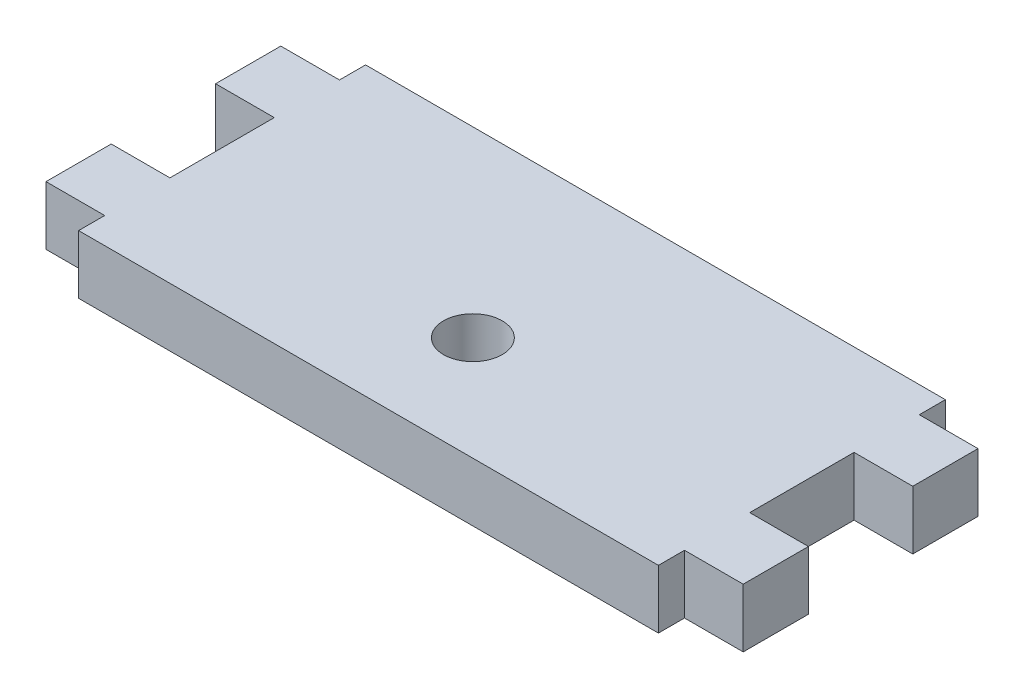
ISO-10303-21;
HEADER;
FILE_DESCRIPTION(('STEP AP214'),'2;1');
FILE_NAME('part.step','',(''),(''),'','','');
FILE_SCHEMA(('AUTOMOTIVE_DESIGN { 1 0 10303 214 1 1 1 1 }'));
ENDSEC;
DATA;
#1=APPLICATION_CONTEXT('core data for automotive mechanical design processes');
#2=APPLICATION_PROTOCOL_DEFINITION('international standard','automotive_design',2000,#1);
#3=PRODUCT_CONTEXT('',#1,'mechanical');
#4=PRODUCT('Part','Part','',(#3));
#5=PRODUCT_RELATED_PRODUCT_CATEGORY('part','',(#4));
#6=PRODUCT_DEFINITION_FORMATION('','',#4);
#7=PRODUCT_DEFINITION_CONTEXT('part definition',#1,'design');
#8=PRODUCT_DEFINITION('design','',#6,#7);
#9=PRODUCT_DEFINITION_SHAPE('','',#8);
#10=(LENGTH_UNIT() NAMED_UNIT(*) SI_UNIT(.MILLI.,.METRE.));
#11=(NAMED_UNIT(*) PLANE_ANGLE_UNIT() SI_UNIT($,.RADIAN.));
#12=(NAMED_UNIT(*) SI_UNIT($,.STERADIAN.) SOLID_ANGLE_UNIT());
#13=UNCERTAINTY_MEASURE_WITH_UNIT(LENGTH_MEASURE(1.E-05),#10,'distance_accuracy_value','');
#14=(GEOMETRIC_REPRESENTATION_CONTEXT(3) GLOBAL_UNCERTAINTY_ASSIGNED_CONTEXT((#13)) GLOBAL_UNIT_ASSIGNED_CONTEXT((#10,
#11,#12)) REPRESENTATION_CONTEXT('',''));
#15=CARTESIAN_POINT('',(0.,0.,0.));
#16=DIRECTION('',(0.,0.,1.));
#17=DIRECTION('',(1.,0.,0.));
#18=AXIS2_PLACEMENT_3D('',#15,#16,#17);
#19=CARTESIAN_POINT('',(-22.225,4.5,-11.));
#20=DIRECTION('',(1.,0.,0.));
#21=DIRECTION('',(0.,0.,-1.));
#22=AXIS2_PLACEMENT_3D('',#19,#20,#21);
#23=PLANE('',#22);
#24=DIRECTION('',(0.,0.,1.));
#25=VECTOR('',#24,1.);
#26=CARTESIAN_POINT('',(-22.225,0.,-11.));
#27=LINE('',#26,#25);
#28=CARTESIAN_POINT('',(-22.225,0.,-11.));
#29=VERTEX_POINT('',#28);
#30=CARTESIAN_POINT('',(-22.225,0.,-9.));
#31=VERTEX_POINT('',#30);
#32=EDGE_CURVE('E149',#29,#31,#27,.T.);
#33=ORIENTED_EDGE('',*,*,#32,.T.);
#34=DIRECTION('',(0.,-1.,0.));
#35=VECTOR('',#34,1.);
#36=CARTESIAN_POINT('',(-22.225,4.5,-9.));
#37=LINE('',#36,#35);
#38=CARTESIAN_POINT('',(-22.225,4.5,-9.));
#39=VERTEX_POINT('',#38);
#40=EDGE_CURVE('E11',#39,#31,#37,.T.);
#41=ORIENTED_EDGE('',*,*,#40,.F.);
#42=DIRECTION('',(0.,0.,1.));
#43=VECTOR('',#42,1.);
#44=CARTESIAN_POINT('',(-22.225,4.5,-11.));
#45=LINE('',#44,#43);
#46=CARTESIAN_POINT('',(-22.225,4.5,-11.));
#47=VERTEX_POINT('',#46);
#48=EDGE_CURVE('E171',#47,#39,#45,.T.);
#49=ORIENTED_EDGE('',*,*,#48,.F.);
#50=DIRECTION('',(0.,-1.,0.));
#51=VECTOR('',#50,1.);
#52=CARTESIAN_POINT('',(-22.225,4.5,-11.));
#53=LINE('',#52,#51);
#54=EDGE_CURVE('E148',#47,#29,#53,.T.);
#55=ORIENTED_EDGE('',*,*,#54,.T.);
#56=EDGE_LOOP('',(#33,#41,#49,#55));
#57=FACE_BOUND('',#56,.T.);
#58=ADVANCED_FACE('F31',(#57),#23,.F.);
#59=CARTESIAN_POINT('',(-22.225,4.5,-9.));
#60=DIRECTION('',(0.,0.,1.));
#61=DIRECTION('',(1.,0.,0.));
#62=AXIS2_PLACEMENT_3D('',#59,#60,#61);
#63=PLANE('',#62);
#64=DIRECTION('',(-1.,0.,0.));
#65=VECTOR('',#64,1.);
#66=CARTESIAN_POINT('',(-22.225,0.,-9.));
#67=LINE('',#66,#65);
#68=CARTESIAN_POINT('',(-26.725,0.,-9.));
#69=VERTEX_POINT('',#68);
#70=EDGE_CURVE('E152',#31,#69,#67,.T.);
#71=ORIENTED_EDGE('',*,*,#70,.T.);
#72=DIRECTION('',(0.,-1.,0.));
#73=VECTOR('',#72,1.);
#74=CARTESIAN_POINT('',(-26.725,4.5,-9.));
#75=LINE('',#74,#73);
#76=CARTESIAN_POINT('',(-26.725,4.5,-9.));
#77=VERTEX_POINT('',#76);
#78=EDGE_CURVE('E39',#77,#69,#75,.T.);
#79=ORIENTED_EDGE('',*,*,#78,.F.);
#80=DIRECTION('',(-1.,0.,0.));
#81=VECTOR('',#80,1.);
#82=CARTESIAN_POINT('',(-22.225,4.5,-9.));
#83=LINE('',#82,#81);
#84=EDGE_CURVE('E99',#39,#77,#83,.T.);
#85=ORIENTED_EDGE('',*,*,#84,.F.);
#86=ORIENTED_EDGE('',*,*,#40,.T.);
#87=EDGE_LOOP('',(#71,#79,#85,#86));
#88=FACE_BOUND('',#87,.T.);
#89=ADVANCED_FACE('F329',(#88),#63,.F.);
#90=CARTESIAN_POINT('',(-26.725,4.5,-4.));
#91=DIRECTION('',(1.,0.,0.));
#92=DIRECTION('',(0.,0.,-1.));
#93=AXIS2_PLACEMENT_3D('',#90,#91,#92);
#94=PLANE('',#93);
#95=DIRECTION('',(0.,0.,1.));
#96=VECTOR('',#95,1.);
#97=CARTESIAN_POINT('',(-26.725,0.,-4.));
#98=LINE('',#97,#96);
#99=CARTESIAN_POINT('',(-26.725,0.,-4.));
#100=VERTEX_POINT('',#99);
#101=EDGE_CURVE('E155',#69,#100,#98,.T.);
#102=ORIENTED_EDGE('',*,*,#101,.T.);
#103=DIRECTION('',(0.,-1.,0.));
#104=VECTOR('',#103,1.);
#105=CARTESIAN_POINT('',(-26.725,4.5,-4.));
#106=LINE('',#105,#104);
#107=CARTESIAN_POINT('',(-26.725,4.5,-4.));
#108=VERTEX_POINT('',#107);
#109=EDGE_CURVE('E184',#108,#100,#106,.T.);
#110=ORIENTED_EDGE('',*,*,#109,.F.);
#111=DIRECTION('',(0.,0.,1.));
#112=VECTOR('',#111,1.);
#113=CARTESIAN_POINT('',(-26.725,4.5,-4.));
#114=LINE('',#113,#112);
#115=EDGE_CURVE('E192',#77,#108,#114,.T.);
#116=ORIENTED_EDGE('',*,*,#115,.F.);
#117=ORIENTED_EDGE('',*,*,#78,.T.);
#118=EDGE_LOOP('',(#102,#110,#116,#117));
#119=FACE_BOUND('',#118,.T.);
#120=ADVANCED_FACE('F190',(#119),#94,.F.);
#121=CARTESIAN_POINT('',(-22.225,4.5,-4.));
#122=DIRECTION('',(0.,0.,-1.));
#123=DIRECTION('',(-1.,0.,0.));
#124=AXIS2_PLACEMENT_3D('',#121,#122,#123);
#125=PLANE('',#124);
#126=DIRECTION('',(1.,0.,0.));
#127=VECTOR('',#126,1.);
#128=CARTESIAN_POINT('',(-22.225,0.,-4.));
#129=LINE('',#128,#127);
#130=CARTESIAN_POINT('',(-22.225,0.,-4.));
#131=VERTEX_POINT('',#130);
#132=EDGE_CURVE('E157',#100,#131,#129,.T.);
#133=ORIENTED_EDGE('',*,*,#132,.T.);
#134=DIRECTION('',(0.,-1.,0.));
#135=VECTOR('',#134,1.);
#136=CARTESIAN_POINT('',(-22.225,4.5,-4.));
#137=LINE('',#136,#135);
#138=CARTESIAN_POINT('',(-22.225,4.5,-4.));
#139=VERTEX_POINT('',#138);
#140=EDGE_CURVE('E181',#139,#131,#137,.T.);
#141=ORIENTED_EDGE('',*,*,#140,.F.);
#142=DIRECTION('',(1.,0.,0.));
#143=VECTOR('',#142,1.);
#144=CARTESIAN_POINT('',(-22.225,4.5,-4.));
#145=LINE('',#144,#143);
#146=EDGE_CURVE('E210',#108,#139,#145,.T.);
#147=ORIENTED_EDGE('',*,*,#146,.F.);
#148=ORIENTED_EDGE('',*,*,#109,.T.);
#149=EDGE_LOOP('',(#133,#141,#147,#148));
#150=FACE_BOUND('',#149,.T.);
#151=ADVANCED_FACE('F201',(#150),#125,.F.);
#152=CARTESIAN_POINT('',(-22.225,4.5,-4.));
#153=DIRECTION('',(1.,0.,0.));
#154=DIRECTION('',(0.,0.,-1.));
#155=AXIS2_PLACEMENT_3D('',#152,#153,#154);
#156=PLANE('',#155);
#157=DIRECTION('',(0.,0.,1.));
#158=VECTOR('',#157,1.);
#159=CARTESIAN_POINT('',(-22.225,0.,-4.));
#160=LINE('',#159,#158);
#161=CARTESIAN_POINT('',(-22.225,0.,4.));
#162=VERTEX_POINT('',#161);
#163=EDGE_CURVE('E159',#131,#162,#160,.T.);
#164=ORIENTED_EDGE('',*,*,#163,.T.);
#165=DIRECTION('',(0.,-1.,0.));
#166=VECTOR('',#165,1.);
#167=CARTESIAN_POINT('',(-22.225,4.5,4.));
#168=LINE('',#167,#166);
#169=CARTESIAN_POINT('',(-22.225,4.5,4.));
#170=VERTEX_POINT('',#169);
#171=EDGE_CURVE('E178',#170,#162,#168,.T.);
#172=ORIENTED_EDGE('',*,*,#171,.F.);
#173=DIRECTION('',(0.,0.,1.));
#174=VECTOR('',#173,1.);
#175=CARTESIAN_POINT('',(-22.225,4.5,-4.));
#176=LINE('',#175,#174);
#177=EDGE_CURVE('E207',#139,#170,#176,.T.);
#178=ORIENTED_EDGE('',*,*,#177,.F.);
#179=ORIENTED_EDGE('',*,*,#140,.T.);
#180=EDGE_LOOP('',(#164,#172,#178,#179));
#181=FACE_BOUND('',#180,.T.);
#182=ADVANCED_FACE('F205',(#181),#156,.F.);
#183=CARTESIAN_POINT('',(-22.225,4.5,4.));
#184=DIRECTION('',(0.,0.,1.));
#185=DIRECTION('',(1.,0.,0.));
#186=AXIS2_PLACEMENT_3D('',#183,#184,#185);
#187=PLANE('',#186);
#188=DIRECTION('',(-1.,0.,0.));
#189=VECTOR('',#188,1.);
#190=CARTESIAN_POINT('',(-22.225,0.,4.));
#191=LINE('',#190,#189);
#192=CARTESIAN_POINT('',(-26.725,0.,4.));
#193=VERTEX_POINT('',#192);
#194=EDGE_CURVE('E161',#162,#193,#191,.T.);
#195=ORIENTED_EDGE('',*,*,#194,.T.);
#196=DIRECTION('',(0.,-1.,0.));
#197=VECTOR('',#196,1.);
#198=CARTESIAN_POINT('',(-26.725,4.5,4.));
#199=LINE('',#198,#197);
#200=CARTESIAN_POINT('',(-26.725,4.5,4.));
#201=VERTEX_POINT('',#200);
#202=EDGE_CURVE('E175',#201,#193,#199,.T.);
#203=ORIENTED_EDGE('',*,*,#202,.F.);
#204=DIRECTION('',(-1.,0.,0.));
#205=VECTOR('',#204,1.);
#206=CARTESIAN_POINT('',(-22.225,4.5,4.));
#207=LINE('',#206,#205);
#208=EDGE_CURVE('E209',#170,#201,#207,.T.);
#209=ORIENTED_EDGE('',*,*,#208,.F.);
#210=ORIENTED_EDGE('',*,*,#171,.T.);
#211=EDGE_LOOP('',(#195,#203,#209,#210));
#212=FACE_BOUND('',#211,.T.);
#213=ADVANCED_FACE('F429',(#212),#187,.F.);
#214=CARTESIAN_POINT('',(-26.725,4.5,9.));
#215=DIRECTION('',(1.,0.,0.));
#216=DIRECTION('',(0.,0.,-1.));
#217=AXIS2_PLACEMENT_3D('',#214,#215,#216);
#218=PLANE('',#217);
#219=DIRECTION('',(0.,0.,1.));
#220=VECTOR('',#219,1.);
#221=CARTESIAN_POINT('',(-26.725,0.,9.));
#222=LINE('',#221,#220);
#223=CARTESIAN_POINT('',(-26.725,0.,9.));
#224=VERTEX_POINT('',#223);
#225=EDGE_CURVE('E163',#193,#224,#222,.T.);
#226=ORIENTED_EDGE('',*,*,#225,.T.);
#227=DIRECTION('',(0.,-1.,0.));
#228=VECTOR('',#227,1.);
#229=CARTESIAN_POINT('',(-26.725,4.5,9.));
#230=LINE('',#229,#228);
#231=CARTESIAN_POINT('',(-26.725,4.5,9.));
#232=VERTEX_POINT('',#231);
#233=EDGE_CURVE('E137',#232,#224,#230,.T.);
#234=ORIENTED_EDGE('',*,*,#233,.F.);
#235=DIRECTION('',(0.,0.,1.));
#236=VECTOR('',#235,1.);
#237=CARTESIAN_POINT('',(-26.725,4.5,9.));
#238=LINE('',#237,#236);
#239=EDGE_CURVE('E128',#201,#232,#238,.T.);
#240=ORIENTED_EDGE('',*,*,#239,.F.);
#241=ORIENTED_EDGE('',*,*,#202,.T.);
#242=EDGE_LOOP('',(#226,#234,#240,#241));
#243=FACE_BOUND('',#242,.T.);
#244=ADVANCED_FACE('F426',(#243),#218,.F.);
#245=CARTESIAN_POINT('',(-22.225,4.5,9.));
#246=DIRECTION('',(0.,0.,-1.));
#247=DIRECTION('',(-1.,0.,0.));
#248=AXIS2_PLACEMENT_3D('',#245,#246,#247);
#249=PLANE('',#248);
#250=DIRECTION('',(1.,0.,0.));
#251=VECTOR('',#250,1.);
#252=CARTESIAN_POINT('',(-22.225,0.,9.));
#253=LINE('',#252,#251);
#254=CARTESIAN_POINT('',(-22.225,0.,9.));
#255=VERTEX_POINT('',#254);
#256=EDGE_CURVE('E136',#224,#255,#253,.T.);
#257=ORIENTED_EDGE('',*,*,#256,.T.);
#258=DIRECTION('',(0.,-1.,0.));
#259=VECTOR('',#258,1.);
#260=CARTESIAN_POINT('',(-22.225,4.5,9.));
#261=LINE('',#260,#259);
#262=CARTESIAN_POINT('',(-22.225,4.5,9.));
#263=VERTEX_POINT('',#262);
#264=EDGE_CURVE('E133',#263,#255,#261,.T.);
#265=ORIENTED_EDGE('',*,*,#264,.F.);
#266=DIRECTION('',(1.,0.,0.));
#267=VECTOR('',#266,1.);
#268=CARTESIAN_POINT('',(-22.225,4.5,9.));
#269=LINE('',#268,#267);
#270=EDGE_CURVE('E121',#232,#263,#269,.T.);
#271=ORIENTED_EDGE('',*,*,#270,.F.);
#272=ORIENTED_EDGE('',*,*,#233,.T.);
#273=EDGE_LOOP('',(#257,#265,#271,#272));
#274=FACE_BOUND('',#273,.T.);
#275=ADVANCED_FACE('F134',(#274),#249,.F.);
#276=CARTESIAN_POINT('',(-22.225,4.5,9.));
#277=DIRECTION('',(1.,0.,0.));
#278=DIRECTION('',(0.,0.,-1.));
#279=AXIS2_PLACEMENT_3D('',#276,#277,#278);
#280=PLANE('',#279);
#281=DIRECTION('',(0.,0.,1.));
#282=VECTOR('',#281,1.);
#283=CARTESIAN_POINT('',(-22.225,0.,9.));
#284=LINE('',#283,#282);
#285=CARTESIAN_POINT('',(-22.225,0.,11.));
#286=VERTEX_POINT('',#285);
#287=EDGE_CURVE('E84',#255,#286,#284,.T.);
#288=ORIENTED_EDGE('',*,*,#287,.T.);
#289=DIRECTION('',(0.,-1.,0.));
#290=VECTOR('',#289,1.);
#291=CARTESIAN_POINT('',(-22.225,4.5,11.));
#292=LINE('',#291,#290);
#293=CARTESIAN_POINT('',(-22.225,4.5,11.));
#294=VERTEX_POINT('',#293);
#295=EDGE_CURVE('E138',#294,#286,#292,.T.);
#296=ORIENTED_EDGE('',*,*,#295,.F.);
#297=DIRECTION('',(0.,0.,1.));
#298=VECTOR('',#297,1.);
#299=CARTESIAN_POINT('',(-22.225,4.5,9.));
#300=LINE('',#299,#298);
#301=EDGE_CURVE('E126',#263,#294,#300,.T.);
#302=ORIENTED_EDGE('',*,*,#301,.F.);
#303=ORIENTED_EDGE('',*,*,#264,.T.);
#304=EDGE_LOOP('',(#288,#296,#302,#303));
#305=FACE_BOUND('',#304,.T.);
#306=ADVANCED_FACE('F140',(#305),#280,.F.);
#307=CARTESIAN_POINT('',(-22.225,4.5,11.));
#308=DIRECTION('',(0.,0.,-1.));
#309=DIRECTION('',(-1.,0.,0.));
#310=AXIS2_PLACEMENT_3D('',#307,#308,#309);
#311=PLANE('',#310);
#312=DIRECTION('',(1.,0.,0.));
#313=VECTOR('',#312,1.);
#314=CARTESIAN_POINT('',(-22.225,0.,11.));
#315=LINE('',#314,#313);
#316=CARTESIAN_POINT('',(22.225,0.,11.));
#317=VERTEX_POINT('',#316);
#318=EDGE_CURVE('E167',#286,#317,#315,.T.);
#319=ORIENTED_EDGE('',*,*,#318,.T.);
#320=DIRECTION('',(0.,-1.,0.));
#321=VECTOR('',#320,1.);
#322=CARTESIAN_POINT('',(22.225,4.5,11.));
#323=LINE('',#322,#321);
#324=CARTESIAN_POINT('',(22.225,4.5,11.));
#325=VERTEX_POINT('',#324);
#326=EDGE_CURVE('E219',#325,#317,#323,.T.);
#327=ORIENTED_EDGE('',*,*,#326,.F.);
#328=DIRECTION('',(1.,0.,0.));
#329=VECTOR('',#328,1.);
#330=CARTESIAN_POINT('',(-22.225,4.5,11.));
#331=LINE('',#330,#329);
#332=EDGE_CURVE('E142',#294,#325,#331,.T.);
#333=ORIENTED_EDGE('',*,*,#332,.F.);
#334=ORIENTED_EDGE('',*,*,#295,.T.);
#335=EDGE_LOOP('',(#319,#327,#333,#334));
#336=FACE_BOUND('',#335,.T.);
#337=ADVANCED_FACE('F325',(#336),#311,.F.);
#338=CARTESIAN_POINT('',(-22.225,4.5,-11.));
#339=DIRECTION('',(0.,0.,1.));
#340=DIRECTION('',(1.,0.,0.));
#341=AXIS2_PLACEMENT_3D('',#338,#339,#340);
#342=PLANE('',#341);
#343=DIRECTION('',(-1.,0.,0.));
#344=VECTOR('',#343,1.);
#345=CARTESIAN_POINT('',(-22.225,0.,-11.));
#346=LINE('',#345,#344);
#347=CARTESIAN_POINT('',(22.225,0.,-11.));
#348=VERTEX_POINT('',#347);
#349=EDGE_CURVE('E91',#348,#29,#346,.T.);
#350=ORIENTED_EDGE('',*,*,#349,.T.);
#351=ORIENTED_EDGE('',*,*,#54,.F.);
#352=DIRECTION('',(-1.,0.,0.));
#353=VECTOR('',#352,1.);
#354=CARTESIAN_POINT('',(-22.225,4.5,-11.));
#355=LINE('',#354,#353);
#356=CARTESIAN_POINT('',(22.225,4.5,-11.));
#357=VERTEX_POINT('',#356);
#358=EDGE_CURVE('E47',#357,#47,#355,.T.);
#359=ORIENTED_EDGE('',*,*,#358,.F.);
#360=DIRECTION('',(0.,-1.,0.));
#361=VECTOR('',#360,1.);
#362=CARTESIAN_POINT('',(22.225,4.5,-11.));
#363=LINE('',#362,#361);
#364=EDGE_CURVE('E153',#357,#348,#363,.T.);
#365=ORIENTED_EDGE('',*,*,#364,.T.);
#366=EDGE_LOOP('',(#350,#351,#359,#365));
#367=FACE_BOUND('',#366,.T.);
#368=ADVANCED_FACE('F316',(#367),#342,.F.);
#369=CARTESIAN_POINT('',(-22.225,4.5,-9.));
#370=DIRECTION('',(0.,-1.,0.));
#371=DIRECTION('',(0.,0.,-1.));
#372=AXIS2_PLACEMENT_3D('',#369,#370,#371);
#373=PLANE('',#372);
#374=CARTESIAN_POINT('',(0.,4.5,3.));
#375=DIRECTION('',(0.,1.,0.));
#376=DIRECTION('',(0.,0.,1.));
#377=AXIS2_PLACEMENT_3D('',#374,#375,#376);
#378=CIRCLE('',#377,2.25);
#379=CARTESIAN_POINT('',(0.,4.5,5.25));
#380=VERTEX_POINT('',#379);
#381=EDGE_CURVE('E301',#380,#380,#378,.T.);
#382=ORIENTED_EDGE('',*,*,#381,.F.);
#383=EDGE_LOOP('',(#382));
#384=FACE_BOUND('',#383,.T.);
#385=ORIENTED_EDGE('',*,*,#48,.T.);
#386=ORIENTED_EDGE('',*,*,#84,.T.);
#387=ORIENTED_EDGE('',*,*,#115,.T.);
#388=ORIENTED_EDGE('',*,*,#146,.T.);
#389=ORIENTED_EDGE('',*,*,#177,.T.);
#390=ORIENTED_EDGE('',*,*,#208,.T.);
#391=ORIENTED_EDGE('',*,*,#239,.T.);
#392=ORIENTED_EDGE('',*,*,#270,.T.);
#393=ORIENTED_EDGE('',*,*,#301,.T.);
#394=ORIENTED_EDGE('',*,*,#332,.T.);
#395=DIRECTION('',(0.,0.,1.));
#396=VECTOR('',#395,1.);
#397=CARTESIAN_POINT('',(22.225,4.5,9.));
#398=LINE('',#397,#396);
#399=CARTESIAN_POINT('',(22.225,4.5,9.));
#400=VERTEX_POINT('',#399);
#401=EDGE_CURVE('E296',#400,#325,#398,.T.);
#402=ORIENTED_EDGE('',*,*,#401,.F.);
#403=DIRECTION('',(-1.,0.,0.));
#404=VECTOR('',#403,1.);
#405=CARTESIAN_POINT('',(22.225,4.5,9.));
#406=LINE('',#405,#404);
#407=CARTESIAN_POINT('',(26.725,4.5,9.));
#408=VERTEX_POINT('',#407);
#409=EDGE_CURVE('E293',#408,#400,#406,.T.);
#410=ORIENTED_EDGE('',*,*,#409,.F.);
#411=DIRECTION('',(0.,0.,1.));
#412=VECTOR('',#411,1.);
#413=CARTESIAN_POINT('',(26.725,4.5,9.));
#414=LINE('',#413,#412);
#415=CARTESIAN_POINT('',(26.725,4.5,4.));
#416=VERTEX_POINT('',#415);
#417=EDGE_CURVE('E290',#416,#408,#414,.T.);
#418=ORIENTED_EDGE('',*,*,#417,.F.);
#419=DIRECTION('',(1.,0.,0.));
#420=VECTOR('',#419,1.);
#421=CARTESIAN_POINT('',(22.225,4.5,4.));
#422=LINE('',#421,#420);
#423=CARTESIAN_POINT('',(22.225,4.5,4.));
#424=VERTEX_POINT('',#423);
#425=EDGE_CURVE('E287',#424,#416,#422,.T.);
#426=ORIENTED_EDGE('',*,*,#425,.F.);
#427=DIRECTION('',(0.,0.,1.));
#428=VECTOR('',#427,1.);
#429=CARTESIAN_POINT('',(22.225,4.5,-4.));
#430=LINE('',#429,#428);
#431=CARTESIAN_POINT('',(22.225,4.5,-4.));
#432=VERTEX_POINT('',#431);
#433=EDGE_CURVE('E284',#432,#424,#430,.T.);
#434=ORIENTED_EDGE('',*,*,#433,.F.);
#435=DIRECTION('',(-1.,0.,0.));
#436=VECTOR('',#435,1.);
#437=CARTESIAN_POINT('',(22.225,4.5,-4.));
#438=LINE('',#437,#436);
#439=CARTESIAN_POINT('',(26.725,4.5,-4.));
#440=VERTEX_POINT('',#439);
#441=EDGE_CURVE('E281',#440,#432,#438,.T.);
#442=ORIENTED_EDGE('',*,*,#441,.F.);
#443=DIRECTION('',(0.,0.,1.));
#444=VECTOR('',#443,1.);
#445=CARTESIAN_POINT('',(26.725,4.5,-4.));
#446=LINE('',#445,#444);
#447=CARTESIAN_POINT('',(26.725,4.5,-9.));
#448=VERTEX_POINT('',#447);
#449=EDGE_CURVE('E278',#448,#440,#446,.T.);
#450=ORIENTED_EDGE('',*,*,#449,.F.);
#451=DIRECTION('',(1.,0.,0.));
#452=VECTOR('',#451,1.);
#453=CARTESIAN_POINT('',(22.225,4.5,-9.));
#454=LINE('',#453,#452);
#455=CARTESIAN_POINT('',(22.225,4.5,-9.));
#456=VERTEX_POINT('',#455);
#457=EDGE_CURVE('E246',#456,#448,#454,.T.);
#458=ORIENTED_EDGE('',*,*,#457,.F.);
#459=DIRECTION('',(0.,0.,1.));
#460=VECTOR('',#459,1.);
#461=CARTESIAN_POINT('',(22.225,4.5,-11.));
#462=LINE('',#461,#460);
#463=EDGE_CURVE('E250',#357,#456,#462,.T.);
#464=ORIENTED_EDGE('',*,*,#463,.F.);
#465=ORIENTED_EDGE('',*,*,#358,.T.);
#466=EDGE_LOOP('',(#385,#386,#387,#388,#389,#390,#391,#392,#393,#394,#402,#410,#418,#426,#434,
#442,#450,#458,#464,#465));
#467=FACE_BOUND('',#466,.T.);
#468=ADVANCED_FACE('F123',(#384,#467),#373,.F.);
#469=CARTESIAN_POINT('',(-22.225,0.,-9.));
#470=DIRECTION('',(0.,-1.,0.));
#471=DIRECTION('',(0.,0.,-1.));
#472=AXIS2_PLACEMENT_3D('',#469,#470,#471);
#473=PLANE('',#472);
#474=CARTESIAN_POINT('',(0.,0.,3.));
#475=DIRECTION('',(0.,1.,0.));
#476=DIRECTION('',(0.,0.,1.));
#477=AXIS2_PLACEMENT_3D('',#474,#475,#476);
#478=CIRCLE('',#477,2.25);
#479=CARTESIAN_POINT('',(0.,0.,5.25));
#480=VERTEX_POINT('',#479);
#481=EDGE_CURVE('E275',#480,#480,#478,.T.);
#482=ORIENTED_EDGE('',*,*,#481,.T.);
#483=EDGE_LOOP('',(#482));
#484=FACE_BOUND('',#483,.T.);
#485=ORIENTED_EDGE('',*,*,#32,.F.);
#486=ORIENTED_EDGE('',*,*,#349,.F.);
#487=DIRECTION('',(0.,0.,1.));
#488=VECTOR('',#487,1.);
#489=CARTESIAN_POINT('',(22.225,0.,-11.));
#490=LINE('',#489,#488);
#491=CARTESIAN_POINT('',(22.225,0.,-9.));
#492=VERTEX_POINT('',#491);
#493=EDGE_CURVE('E272',#348,#492,#490,.T.);
#494=ORIENTED_EDGE('',*,*,#493,.T.);
#495=DIRECTION('',(1.,0.,0.));
#496=VECTOR('',#495,1.);
#497=CARTESIAN_POINT('',(22.225,0.,-9.));
#498=LINE('',#497,#496);
#499=CARTESIAN_POINT('',(26.725,0.,-9.));
#500=VERTEX_POINT('',#499);
#501=EDGE_CURVE('E247',#492,#500,#498,.T.);
#502=ORIENTED_EDGE('',*,*,#501,.T.);
#503=DIRECTION('',(0.,0.,1.));
#504=VECTOR('',#503,1.);
#505=CARTESIAN_POINT('',(26.725,0.,-4.));
#506=LINE('',#505,#504);
#507=CARTESIAN_POINT('',(26.725,0.,-4.));
#508=VERTEX_POINT('',#507);
#509=EDGE_CURVE('E251',#500,#508,#506,.T.);
#510=ORIENTED_EDGE('',*,*,#509,.T.);
#511=DIRECTION('',(-1.,0.,0.));
#512=VECTOR('',#511,1.);
#513=CARTESIAN_POINT('',(22.225,0.,-4.));
#514=LINE('',#513,#512);
#515=CARTESIAN_POINT('',(22.225,0.,-4.));
#516=VERTEX_POINT('',#515);
#517=EDGE_CURVE('E254',#508,#516,#514,.T.);
#518=ORIENTED_EDGE('',*,*,#517,.T.);
#519=DIRECTION('',(0.,0.,1.));
#520=VECTOR('',#519,1.);
#521=CARTESIAN_POINT('',(22.225,0.,-4.));
#522=LINE('',#521,#520);
#523=CARTESIAN_POINT('',(22.225,0.,4.));
#524=VERTEX_POINT('',#523);
#525=EDGE_CURVE('E257',#516,#524,#522,.T.);
#526=ORIENTED_EDGE('',*,*,#525,.T.);
#527=DIRECTION('',(1.,0.,0.));
#528=VECTOR('',#527,1.);
#529=CARTESIAN_POINT('',(22.225,0.,4.));
#530=LINE('',#529,#528);
#531=CARTESIAN_POINT('',(26.725,0.,4.));
#532=VERTEX_POINT('',#531);
#533=EDGE_CURVE('E260',#524,#532,#530,.T.);
#534=ORIENTED_EDGE('',*,*,#533,.T.);
#535=DIRECTION('',(0.,0.,1.));
#536=VECTOR('',#535,1.);
#537=CARTESIAN_POINT('',(26.725,0.,9.));
#538=LINE('',#537,#536);
#539=CARTESIAN_POINT('',(26.725,0.,9.));
#540=VERTEX_POINT('',#539);
#541=EDGE_CURVE('E263',#532,#540,#538,.T.);
#542=ORIENTED_EDGE('',*,*,#541,.T.);
#543=DIRECTION('',(-1.,0.,0.));
#544=VECTOR('',#543,1.);
#545=CARTESIAN_POINT('',(22.225,0.,9.));
#546=LINE('',#545,#544);
#547=CARTESIAN_POINT('',(22.225,0.,9.));
#548=VERTEX_POINT('',#547);
#549=EDGE_CURVE('E266',#540,#548,#546,.T.);
#550=ORIENTED_EDGE('',*,*,#549,.T.);
#551=DIRECTION('',(0.,0.,1.));
#552=VECTOR('',#551,1.);
#553=CARTESIAN_POINT('',(22.225,0.,9.));
#554=LINE('',#553,#552);
#555=EDGE_CURVE('E269',#548,#317,#554,.T.);
#556=ORIENTED_EDGE('',*,*,#555,.T.);
#557=ORIENTED_EDGE('',*,*,#318,.F.);
#558=ORIENTED_EDGE('',*,*,#287,.F.);
#559=ORIENTED_EDGE('',*,*,#256,.F.);
#560=ORIENTED_EDGE('',*,*,#225,.F.);
#561=ORIENTED_EDGE('',*,*,#194,.F.);
#562=ORIENTED_EDGE('',*,*,#163,.F.);
#563=ORIENTED_EDGE('',*,*,#132,.F.);
#564=ORIENTED_EDGE('',*,*,#101,.F.);
#565=ORIENTED_EDGE('',*,*,#70,.F.);
#566=EDGE_LOOP('',(#485,#486,#494,#502,#510,#518,#526,#534,#542,#550,#556,#557,#558,#559,#560,
#561,#562,#563,#564,#565));
#567=FACE_BOUND('',#566,.T.);
#568=ADVANCED_FACE('F196',(#484,#567),#473,.T.);
#569=CARTESIAN_POINT('',(22.225,4.5,-11.));
#570=DIRECTION('',(1.,0.,0.));
#571=DIRECTION('',(0.,0.,-1.));
#572=AXIS2_PLACEMENT_3D('',#569,#570,#571);
#573=PLANE('',#572);
#574=ORIENTED_EDGE('',*,*,#493,.F.);
#575=ORIENTED_EDGE('',*,*,#364,.F.);
#576=ORIENTED_EDGE('',*,*,#463,.T.);
#577=DIRECTION('',(0.,-1.,0.));
#578=VECTOR('',#577,1.);
#579=CARTESIAN_POINT('',(22.225,4.5,-9.));
#580=LINE('',#579,#578);
#581=EDGE_CURVE('E243',#456,#492,#580,.T.);
#582=ORIENTED_EDGE('',*,*,#581,.T.);
#583=EDGE_LOOP('',(#574,#575,#576,#582));
#584=FACE_BOUND('',#583,.T.);
#585=ADVANCED_FACE('F322',(#584),#573,.T.);
#586=CARTESIAN_POINT('',(22.225,4.5,9.));
#587=DIRECTION('',(1.,0.,0.));
#588=DIRECTION('',(0.,0.,-1.));
#589=AXIS2_PLACEMENT_3D('',#586,#587,#588);
#590=PLANE('',#589);
#591=ORIENTED_EDGE('',*,*,#555,.F.);
#592=DIRECTION('',(0.,-1.,0.));
#593=VECTOR('',#592,1.);
#594=CARTESIAN_POINT('',(22.225,4.5,9.));
#595=LINE('',#594,#593);
#596=EDGE_CURVE('E222',#400,#548,#595,.T.);
#597=ORIENTED_EDGE('',*,*,#596,.F.);
#598=ORIENTED_EDGE('',*,*,#401,.T.);
#599=ORIENTED_EDGE('',*,*,#326,.T.);
#600=EDGE_LOOP('',(#591,#597,#598,#599));
#601=FACE_BOUND('',#600,.T.);
#602=ADVANCED_FACE('F405',(#601),#590,.T.);
#603=CARTESIAN_POINT('',(22.225,4.5,9.));
#604=DIRECTION('',(0.,0.,1.));
#605=DIRECTION('',(1.,0.,0.));
#606=AXIS2_PLACEMENT_3D('',#603,#604,#605);
#607=PLANE('',#606);
#608=ORIENTED_EDGE('',*,*,#549,.F.);
#609=DIRECTION('',(0.,-1.,0.));
#610=VECTOR('',#609,1.);
#611=CARTESIAN_POINT('',(26.725,4.5,9.));
#612=LINE('',#611,#610);
#613=EDGE_CURVE('E225',#408,#540,#612,.T.);
#614=ORIENTED_EDGE('',*,*,#613,.F.);
#615=ORIENTED_EDGE('',*,*,#409,.T.);
#616=ORIENTED_EDGE('',*,*,#596,.T.);
#617=EDGE_LOOP('',(#608,#614,#615,#616));
#618=FACE_BOUND('',#617,.T.);
#619=ADVANCED_FACE('F399',(#618),#607,.T.);
#620=CARTESIAN_POINT('',(26.725,4.5,9.));
#621=DIRECTION('',(1.,0.,0.));
#622=DIRECTION('',(0.,0.,-1.));
#623=AXIS2_PLACEMENT_3D('',#620,#621,#622);
#624=PLANE('',#623);
#625=ORIENTED_EDGE('',*,*,#541,.F.);
#626=DIRECTION('',(0.,-1.,0.));
#627=VECTOR('',#626,1.);
#628=CARTESIAN_POINT('',(26.725,4.5,4.));
#629=LINE('',#628,#627);
#630=EDGE_CURVE('E228',#416,#532,#629,.T.);
#631=ORIENTED_EDGE('',*,*,#630,.F.);
#632=ORIENTED_EDGE('',*,*,#417,.T.);
#633=ORIENTED_EDGE('',*,*,#613,.T.);
#634=EDGE_LOOP('',(#625,#631,#632,#633));
#635=FACE_BOUND('',#634,.T.);
#636=ADVANCED_FACE('F392',(#635),#624,.T.);
#637=CARTESIAN_POINT('',(22.225,4.5,4.));
#638=DIRECTION('',(0.,0.,-1.));
#639=DIRECTION('',(-1.,0.,0.));
#640=AXIS2_PLACEMENT_3D('',#637,#638,#639);
#641=PLANE('',#640);
#642=ORIENTED_EDGE('',*,*,#533,.F.);
#643=DIRECTION('',(0.,-1.,0.));
#644=VECTOR('',#643,1.);
#645=CARTESIAN_POINT('',(22.225,4.5,4.));
#646=LINE('',#645,#644);
#647=EDGE_CURVE('E231',#424,#524,#646,.T.);
#648=ORIENTED_EDGE('',*,*,#647,.F.);
#649=ORIENTED_EDGE('',*,*,#425,.T.);
#650=ORIENTED_EDGE('',*,*,#630,.T.);
#651=EDGE_LOOP('',(#642,#648,#649,#650));
#652=FACE_BOUND('',#651,.T.);
#653=ADVANCED_FACE('F387',(#652),#641,.T.);
#654=CARTESIAN_POINT('',(22.225,4.5,-4.));
#655=DIRECTION('',(1.,0.,0.));
#656=DIRECTION('',(0.,0.,-1.));
#657=AXIS2_PLACEMENT_3D('',#654,#655,#656);
#658=PLANE('',#657);
#659=ORIENTED_EDGE('',*,*,#525,.F.);
#660=DIRECTION('',(0.,-1.,0.));
#661=VECTOR('',#660,1.);
#662=CARTESIAN_POINT('',(22.225,4.5,-4.));
#663=LINE('',#662,#661);
#664=EDGE_CURVE('E234',#432,#516,#663,.T.);
#665=ORIENTED_EDGE('',*,*,#664,.F.);
#666=ORIENTED_EDGE('',*,*,#433,.T.);
#667=ORIENTED_EDGE('',*,*,#647,.T.);
#668=EDGE_LOOP('',(#659,#665,#666,#667));
#669=FACE_BOUND('',#668,.T.);
#670=ADVANCED_FACE('F381',(#669),#658,.T.);
#671=CARTESIAN_POINT('',(22.225,4.5,-4.));
#672=DIRECTION('',(0.,0.,1.));
#673=DIRECTION('',(1.,0.,0.));
#674=AXIS2_PLACEMENT_3D('',#671,#672,#673);
#675=PLANE('',#674);
#676=ORIENTED_EDGE('',*,*,#517,.F.);
#677=DIRECTION('',(0.,-1.,0.));
#678=VECTOR('',#677,1.);
#679=CARTESIAN_POINT('',(26.725,4.5,-4.));
#680=LINE('',#679,#678);
#681=EDGE_CURVE('E237',#440,#508,#680,.T.);
#682=ORIENTED_EDGE('',*,*,#681,.F.);
#683=ORIENTED_EDGE('',*,*,#441,.T.);
#684=ORIENTED_EDGE('',*,*,#664,.T.);
#685=EDGE_LOOP('',(#676,#682,#683,#684));
#686=FACE_BOUND('',#685,.T.);
#687=ADVANCED_FACE('F375',(#686),#675,.T.);
#688=CARTESIAN_POINT('',(26.725,4.5,-4.));
#689=DIRECTION('',(1.,0.,0.));
#690=DIRECTION('',(0.,0.,-1.));
#691=AXIS2_PLACEMENT_3D('',#688,#689,#690);
#692=PLANE('',#691);
#693=ORIENTED_EDGE('',*,*,#509,.F.);
#694=DIRECTION('',(0.,-1.,0.));
#695=VECTOR('',#694,1.);
#696=CARTESIAN_POINT('',(26.725,4.5,-9.));
#697=LINE('',#696,#695);
#698=EDGE_CURVE('E240',#448,#500,#697,.T.);
#699=ORIENTED_EDGE('',*,*,#698,.F.);
#700=ORIENTED_EDGE('',*,*,#449,.T.);
#701=ORIENTED_EDGE('',*,*,#681,.T.);
#702=EDGE_LOOP('',(#693,#699,#700,#701));
#703=FACE_BOUND('',#702,.T.);
#704=ADVANCED_FACE('F370',(#703),#692,.T.);
#705=CARTESIAN_POINT('',(22.225,4.5,-9.));
#706=DIRECTION('',(0.,0.,-1.));
#707=DIRECTION('',(-1.,0.,0.));
#708=AXIS2_PLACEMENT_3D('',#705,#706,#707);
#709=PLANE('',#708);
#710=ORIENTED_EDGE('',*,*,#501,.F.);
#711=ORIENTED_EDGE('',*,*,#581,.F.);
#712=ORIENTED_EDGE('',*,*,#457,.T.);
#713=ORIENTED_EDGE('',*,*,#698,.T.);
#714=EDGE_LOOP('',(#710,#711,#712,#713));
#715=FACE_BOUND('',#714,.T.);
#716=ADVANCED_FACE('F311',(#715),#709,.T.);
#717=CARTESIAN_POINT('',(0.,0.,3.));
#718=DIRECTION('',(0.,1.,0.));
#719=DIRECTION('',(0.,0.,1.));
#720=AXIS2_PLACEMENT_3D('',#717,#718,#719);
#721=CYLINDRICAL_SURFACE('',#720,2.25);
#722=ORIENTED_EDGE('',*,*,#481,.F.);
#723=EDGE_LOOP('',(#722));
#724=FACE_BOUND('',#723,.T.);
#725=ORIENTED_EDGE('',*,*,#381,.T.);
#726=EDGE_LOOP('',(#725));
#727=FACE_BOUND('',#726,.T.);
#728=ADVANCED_FACE('F308',(#724,#727),#721,.F.);
#729=CLOSED_SHELL('',(#58,#89,#120,#151,#182,#213,#244,#275,#306,#337,#368,#468,#568,#585,#602,
#619,#636,#653,#670,#687,#704,#716,#728));
#730=MANIFOLD_SOLID_BREP('B2',#729);
#731=ADVANCED_BREP_SHAPE_REPRESENTATION('',(#18,#730),#14);
#732=SHAPE_DEFINITION_REPRESENTATION(#9,#731);
ENDSEC;
END-ISO-10303-21;
